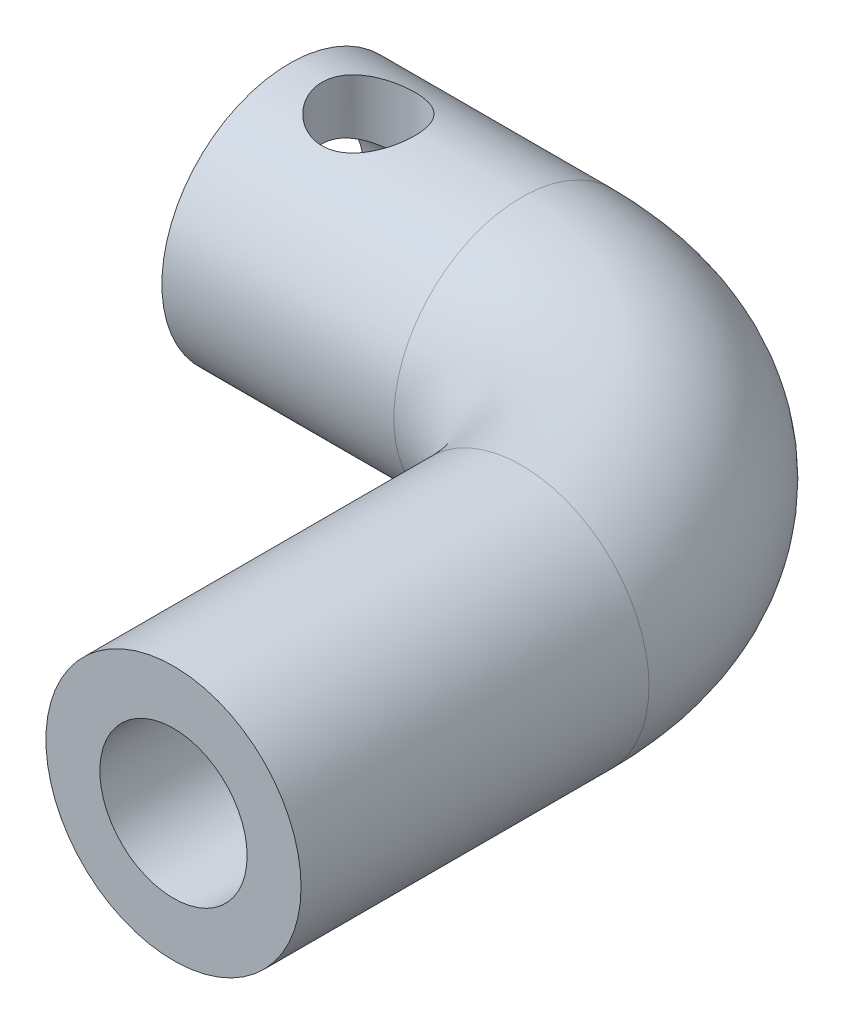
ISO-10303-21;
HEADER;
FILE_DESCRIPTION(('STEP AP214'),'2;1');
FILE_NAME('part.step','',(''),(''),'','','');
FILE_SCHEMA(('AUTOMOTIVE_DESIGN { 1 0 10303 214 1 1 1 1 }'));
ENDSEC;
DATA;
#1=APPLICATION_CONTEXT('core data for automotive mechanical design processes');
#2=APPLICATION_PROTOCOL_DEFINITION('international standard','automotive_design',2000,#1);
#3=PRODUCT_CONTEXT('',#1,'mechanical');
#4=PRODUCT('Part','Part','',(#3));
#5=PRODUCT_RELATED_PRODUCT_CATEGORY('part','',(#4));
#6=PRODUCT_DEFINITION_FORMATION('','',#4);
#7=PRODUCT_DEFINITION_CONTEXT('part definition',#1,'design');
#8=PRODUCT_DEFINITION('design','',#6,#7);
#9=PRODUCT_DEFINITION_SHAPE('','',#8);
#10=(LENGTH_UNIT() NAMED_UNIT(*) SI_UNIT(.MILLI.,.METRE.));
#11=(NAMED_UNIT(*) PLANE_ANGLE_UNIT() SI_UNIT($,.RADIAN.));
#12=(NAMED_UNIT(*) SI_UNIT($,.STERADIAN.) SOLID_ANGLE_UNIT());
#13=UNCERTAINTY_MEASURE_WITH_UNIT(LENGTH_MEASURE(1.E-05),#10,'distance_accuracy_value','');
#14=(GEOMETRIC_REPRESENTATION_CONTEXT(3) GLOBAL_UNCERTAINTY_ASSIGNED_CONTEXT((#13)) GLOBAL_UNIT_ASSIGNED_CONTEXT((#10,
#11,#12)) REPRESENTATION_CONTEXT('',''));
#15=CARTESIAN_POINT('',(0.,0.,0.));
#16=DIRECTION('',(0.,0.,1.));
#17=DIRECTION('',(1.,0.,0.));
#18=AXIS2_PLACEMENT_3D('',#15,#16,#17);
#19=CARTESIAN_POINT('',(-7.5,0.,0.));
#20=DIRECTION('',(-1.,0.,0.));
#21=DIRECTION('',(0.,0.,1.));
#22=AXIS2_PLACEMENT_3D('',#19,#20,#21);
#23=CYLINDRICAL_SURFACE('',#22,3.2);
#24=CARTESIAN_POINT('',(-17.5,0.,0.));
#25=DIRECTION('',(-1.,0.,0.));
#26=DIRECTION('',(0.,0.,1.));
#27=AXIS2_PLACEMENT_3D('',#24,#25,#26);
#28=CIRCLE('',#27,3.2);
#29=CARTESIAN_POINT('',(-17.5,0.,3.2));
#30=VERTEX_POINT('',#29);
#31=EDGE_CURVE('E108',#30,#30,#28,.T.);
#32=ORIENTED_EDGE('',*,*,#31,.T.);
#33=EDGE_LOOP('',(#32));
#34=FACE_BOUND('',#33,.T.);
#35=CARTESIAN_POINT('',(-14.0962512619777,2.49799919935936,-2.));
#36=CARTESIAN_POINT('',(-13.996858811093,2.49801280116094,-1.99999139536776));
#37=CARTESIAN_POINT('',(-13.8973107253853,2.50404228334139,-1.99252310159465));
#38=CARTESIAN_POINT('',(-13.7015691498507,2.52709947528765,-1.96318321332694));
#39=CARTESIAN_POINT('',(-13.6053855237933,2.54415706342585,-1.94127248688881));
#40=CARTESIAN_POINT('',(-13.4197995456595,2.58640136526467,-1.88460918258991));
#41=CARTESIAN_POINT('',(-13.3303462880868,2.61151739868855,-1.84996789332453));
#42=CARTESIAN_POINT('',(-13.1586370833566,2.66692721143094,-1.76915112899075));
#43=CARTESIAN_POINT('',(-13.0763813326072,2.69722113197884,-1.72297533929742));
#44=CARTESIAN_POINT('',(-12.9092670148145,2.76447378199541,-1.61318300685378));
#45=CARTESIAN_POINT('',(-12.8255396766455,2.80178141163757,-1.54805774990795));
#46=CARTESIAN_POINT('',(-12.6692389433457,2.87604513367806,-1.40529386319494));
#47=CARTESIAN_POINT('',(-12.5966752663234,2.9130008938133,-1.32764445007579));
#48=CARTESIAN_POINT('',(-12.4560855257407,2.98767126225618,-1.1506986644135));
#49=CARTESIAN_POINT('',(-12.3896629930108,3.02493955586323,-1.0499209102568));
#50=CARTESIAN_POINT('',(-12.2752509343566,3.09093170718627,-0.835846513339611));
#51=CARTESIAN_POINT('',(-12.2272431567757,3.11966401887744,-0.722562410365085));
#52=CARTESIAN_POINT('',(-12.1562795650064,3.16271746109122,-0.498843005379134));
#53=CARTESIAN_POINT('',(-12.1312729957426,3.17820675875259,-0.3892890176755));
#54=CARTESIAN_POINT('',(-12.1000399505483,3.19760871006727,-0.166568161059514));
#55=CARTESIAN_POINT('',(-12.0937937321849,3.20153353349864,-0.0534052169023041));
#56=CARTESIAN_POINT('',(-12.1000203648219,3.19764654572032,0.156905325474192));
#57=CARTESIAN_POINT('',(-12.1100934640591,3.19133919699003,0.254164037238002));
#58=CARTESIAN_POINT('',(-12.1440384369591,3.17032435617998,0.445290633446095));
#59=CARTESIAN_POINT('',(-12.167911353558,3.15561622920332,0.539158261035764));
#60=CARTESIAN_POINT('',(-12.2284173021329,3.11901013783332,0.721422587322864));
#61=CARTESIAN_POINT('',(-12.2650829804546,3.09709378677711,0.809804600787276));
#62=CARTESIAN_POINT('',(-12.3498012703946,3.04777012623473,0.979230752753056));
#63=CARTESIAN_POINT('',(-12.3978564762059,3.02036156600799,1.06027321370343));
#64=CARTESIAN_POINT('',(-12.5106963265011,2.95829159598973,1.22354162489906));
#65=CARTESIAN_POINT('',(-12.5768186647512,2.92315206882378,1.30465975183771));
#66=CARTESIAN_POINT('',(-12.7204630703495,2.8511274041264,1.45535775348159));
#67=CARTESIAN_POINT('',(-12.7980017043459,2.81423978352652,1.52492054218617));
#68=CARTESIAN_POINT('',(-12.9741802585685,2.73714307341023,1.65976713414942));
#69=CARTESIAN_POINT('',(-13.0742534711014,2.69712930300851,1.723305847132));
#70=CARTESIAN_POINT('',(-13.2860850533787,2.62422622402613,1.83241845071326));
#71=CARTESIAN_POINT('',(-13.3978214122478,2.59132384272274,1.87802543352875));
#72=CARTESIAN_POINT('',(-13.599882306636,2.54547002532879,1.9394970697411));
#73=CARTESIAN_POINT('',(-13.6881088022082,2.5295472689526,1.96002946757177));
#74=CARTESIAN_POINT('',(-13.8676355639661,2.50686622194407,1.98896269657621));
#75=CARTESIAN_POINT('',(-13.958931455639,2.50009541178056,1.99738010164592));
#76=CARTESIAN_POINT('',(-14.1422171508449,2.49673813650095,2.00157657527863));
#77=CARTESIAN_POINT('',(-14.2342080641638,2.50017501025188,1.99732668122696));
#78=CARTESIAN_POINT('',(-14.4159001916276,2.51673668579837,1.97641173689404));
#79=CARTESIAN_POINT('',(-14.5055994459183,2.52986951047321,1.95973640512371));
#80=CARTESIAN_POINT('',(-14.6790006761633,2.56368096963262,1.91527897159771));
#81=CARTESIAN_POINT('',(-14.7627771393083,2.58423164699511,1.8876844900287));
#82=CARTESIAN_POINT('',(-14.9247109972689,2.63064917505314,1.8224392310162));
#83=CARTESIAN_POINT('',(-15.002866385217,2.65651791183846,1.78478488434266));
#84=CARTESIAN_POINT('',(-15.1671409246611,2.71659526382314,1.6922460283571));
#85=CARTESIAN_POINT('',(-15.2519433279767,2.7514540118127,1.63544598102749));
#86=CARTESIAN_POINT('',(-15.4117473458804,2.82230332801138,1.5099044211597));
#87=CARTESIAN_POINT('',(-15.4867386491425,2.85829503845369,1.44115051919448));
#88=CARTESIAN_POINT('',(-15.6370244559668,2.93413062430361,1.28060905519863));
#89=CARTESIAN_POINT('',(-15.7104409531901,2.97366727660159,1.18689591954257));
#90=CARTESIAN_POINT('',(-15.8403611049791,3.04614798344002,0.98607998059122));
#91=CARTESIAN_POINT('',(-15.8968726859356,3.07909512526615,0.878983485997751));
#92=CARTESIAN_POINT('',(-15.987443247902,3.13294809532101,0.660681441018446));
#93=CARTESIAN_POINT('',(-16.022641992331,3.1544557534269,0.550103716071117));
#94=CARTESIAN_POINT('',(-16.0734139318675,3.18571216140865,0.322977598215483));
#95=CARTESIAN_POINT('',(-16.0890142855955,3.19547718292806,0.206437701181278));
#96=CARTESIAN_POINT('',(-16.0987256940398,3.20154697197694,-0.0105585151950039));
#97=CARTESIAN_POINT('',(-16.0956685048369,3.19962560997786,-0.110850076152861));
#98=CARTESIAN_POINT('',(-16.0747125820188,3.18657183934034,-0.309247697746858));
#99=CARTESIAN_POINT('',(-16.0568145218565,3.17543984866428,-0.407353857345283));
#100=CARTESIAN_POINT('',(-16.0079945021751,3.14553767502366,-0.595269271496931));
#101=CARTESIAN_POINT('',(-15.9775459181806,3.1270458795472,-0.685248289085383));
#102=CARTESIAN_POINT('',(-15.9049553769152,3.08391949883621,-0.858742990578189));
#103=CARTESIAN_POINT('',(-15.8628114468167,3.05928387730246,-0.942257580989267));
#104=CARTESIAN_POINT('',(-15.7631943355917,3.00280547583716,-1.10985077995315));
#105=CARTESIAN_POINT('',(-15.7045840918673,2.97048003947126,-1.19308820345962));
#106=CARTESIAN_POINT('',(-15.5761286534453,2.90293824729977,-1.34914657336874));
#107=CARTESIAN_POINT('',(-15.5062707815841,2.86771865168989,-1.42195558888844));
#108=CARTESIAN_POINT('',(-15.3456652422924,2.79200664159236,-1.56595776208136));
#109=CARTESIAN_POINT('',(-15.2533579096946,2.75148594314098,-1.63540527798112));
#110=CARTESIAN_POINT('',(-15.0568197963614,2.67479714395255,-1.75803720009196));
#111=CARTESIAN_POINT('',(-14.9525956541255,2.63862664267279,-1.81123060091365));
#112=CARTESIAN_POINT('',(-14.7580068332901,2.58287641728339,-1.88958577477173));
#113=CARTESIAN_POINT('',(-14.6696341725706,2.56139744559441,-1.91833946042213));
#114=CARTESIAN_POINT('',(-14.4883004172461,2.52702653500701,-1.96340515488654));
#115=CARTESIAN_POINT('',(-14.395354853939,2.5141074304028,-1.97975654792649));
#116=CARTESIAN_POINT('',(-14.2674024237971,2.5036233022303,-1.99295849892956));
#117=CARTESIAN_POINT('',(-14.2332686291505,2.50152111274923,-1.9955947401533));
#118=CARTESIAN_POINT('',(-14.1648465155433,2.49870653912074,-1.99911719574861));
#119=CARTESIAN_POINT('',(-14.130558159895,2.49799450447948,-2.00000297002677));
#120=CARTESIAN_POINT('',(-14.0962512619777,2.49799919935936,-2.));
#121=B_SPLINE_CURVE_WITH_KNOTS('',3,(#35,#36,#37,#38,#39,#40,#41,#42,#43,#44,#45,#46,#47,#48,
#49,#50,#51,#52,#53,#54,#55,#56,#57,#58,#59,#60,#61,#62,#63,#64,#65,#66,#67,#68,#69,#70,#71,#72,
#73,#74,#75,#76,#77,#78,#79,#80,#81,#82,#83,#84,#85,#86,#87,#88,#89,#90,#91,#92,#93,#94,#95,#96,
#97,#98,#99,#100,#101,#102,#103,#104,#105,#106,#107,#108,#109,#110,#111,#112,#113,#114,#115,
#116,#117,#118,#119,#120),.UNSPECIFIED.,.T.,.F.,(4,2,2,2,2,2,2,2,2,2,2,2,2,2,2,2,2,2,2,2,2,2,2,
2,2,2,2,2,2,2,2,2,2,2,2,2,2,2,2,2,2,2,4),(0.,0.298019910419245,0.596850647035399,
0.893128889808709,1.18941521500449,1.52544993190421,1.86177553596668,2.23867577655141,
2.61520148382827,2.95344660504646,3.29133564947829,3.58387711333626,3.8764406892227,
4.16975639721538,4.46313897805083,4.79303207731381,5.12340870425907,5.49692908673939,
5.86975688155524,6.14452440771508,6.41891568014742,6.69393480388261,6.96918174659207,
7.23989139752836,7.51069722382495,7.83306133779285,8.15576157579487,8.53018557860504,
8.90443374501683,9.25632128794359,9.60772066017418,9.90725762443277,10.2067809969681,
10.4959131058616,10.7850940166369,11.1042903057707,11.4238489113727,11.7894690787708,
12.154886553397,12.4399504363574,12.724105247445,12.8269457451427,12.929812095183),.UNSPECIFIED.);
#122=CARTESIAN_POINT('',(-14.0962512619777,2.49799919935936,-2.));
#123=VERTEX_POINT('',#122);
#124=EDGE_CURVE('E150',#123,#123,#121,.T.);
#125=ORIENTED_EDGE('',*,*,#124,.F.);
#126=EDGE_LOOP('',(#125));
#127=FACE_BOUND('',#126,.T.);
#128=DIRECTION('',(-1.,0.,0.));
#129=VECTOR('',#128,1.);
#130=CARTESIAN_POINT('',(-7.5,0.5,-3.16069612585582));
#131=LINE('',#130,#129);
#132=CARTESIAN_POINT('',(-7.5,0.5,-3.16069612585582));
#133=VERTEX_POINT('',#132);
#134=CARTESIAN_POINT('',(-8.5,0.5,-3.16069612585582));
#135=VERTEX_POINT('',#134);
#136=EDGE_CURVE('E69',#133,#135,#131,.T.);
#137=ORIENTED_EDGE('',*,*,#136,.F.);
#138=CARTESIAN_POINT('',(-7.5,0.,0.));
#139=DIRECTION('',(-1.,0.,0.));
#140=DIRECTION('',(0.,0.,1.));
#141=AXIS2_PLACEMENT_3D('',#138,#139,#140);
#142=CIRCLE('',#141,3.2);
#143=CARTESIAN_POINT('',(-7.5,0.5,3.16069612585582));
#144=VERTEX_POINT('',#143);
#145=EDGE_CURVE('E107',#144,#133,#142,.T.);
#146=ORIENTED_EDGE('',*,*,#145,.F.);
#147=DIRECTION('',(-1.,0.,0.));
#148=VECTOR('',#147,1.);
#149=CARTESIAN_POINT('',(-7.5,0.5,3.16069612585582));
#150=LINE('',#149,#148);
#151=CARTESIAN_POINT('',(-8.5,0.5,3.16069612585582));
#152=VERTEX_POINT('',#151);
#153=EDGE_CURVE('E157',#152,#144,#150,.F.);
#154=ORIENTED_EDGE('',*,*,#153,.F.);
#155=CARTESIAN_POINT('',(-8.5,0.,0.));
#156=DIRECTION('',(-1.,0.,0.));
#157=DIRECTION('',(0.,0.,1.));
#158=AXIS2_PLACEMENT_3D('',#155,#156,#157);
#159=CIRCLE('',#158,3.2);
#160=CARTESIAN_POINT('',(-8.5,-0.5,3.16069612585582));
#161=VERTEX_POINT('',#160);
#162=EDGE_CURVE('E49',#152,#161,#159,.F.);
#163=ORIENTED_EDGE('',*,*,#162,.T.);
#164=DIRECTION('',(-1.,0.,0.));
#165=VECTOR('',#164,1.);
#166=CARTESIAN_POINT('',(-7.5,-0.5,3.16069612585582));
#167=LINE('',#166,#165);
#168=CARTESIAN_POINT('',(-7.5,-0.5,3.16069612585582));
#169=VERTEX_POINT('',#168);
#170=EDGE_CURVE('E89',#169,#161,#167,.T.);
#171=ORIENTED_EDGE('',*,*,#170,.F.);
#172=CARTESIAN_POINT('',(-7.5,-0.5,-3.16069612585582));
#173=VERTEX_POINT('',#172);
#174=EDGE_CURVE('E100',#173,#169,#142,.T.);
#175=ORIENTED_EDGE('',*,*,#174,.F.);
#176=DIRECTION('',(-1.,0.,0.));
#177=VECTOR('',#176,1.);
#178=CARTESIAN_POINT('',(-7.5,-0.5,-3.16069612585582));
#179=LINE('',#178,#177);
#180=CARTESIAN_POINT('',(-8.5,-0.5,-3.16069612585582));
#181=VERTEX_POINT('',#180);
#182=EDGE_CURVE('E61',#181,#173,#179,.F.);
#183=ORIENTED_EDGE('',*,*,#182,.F.);
#184=EDGE_CURVE('E11',#181,#135,#159,.F.);
#185=ORIENTED_EDGE('',*,*,#184,.T.);
#186=EDGE_LOOP('',(#137,#146,#154,#163,#171,#175,#183,#185));
#187=FACE_BOUND('',#186,.T.);
#188=ADVANCED_FACE('F45',(#34,#127,#187),#23,.F.);
#189=CARTESIAN_POINT('',(-7.5,0.,0.));
#190=DIRECTION('',(-1.,0.,0.));
#191=DIRECTION('',(0.,0.,1.));
#192=AXIS2_PLACEMENT_3D('',#189,#190,#191);
#193=PLANE('',#192);
#194=ORIENTED_EDGE('',*,*,#145,.T.);
#195=DIRECTION('',(0.,0.,1.));
#196=VECTOR('',#195,1.);
#197=CARTESIAN_POINT('',(-7.5,0.5,0.));
#198=LINE('',#197,#196);
#199=EDGE_CURVE('E95',#133,#144,#198,.T.);
#200=ORIENTED_EDGE('',*,*,#199,.T.);
#201=EDGE_LOOP('',(#194,#200));
#202=FACE_BOUND('',#201,.T.);
#203=ADVANCED_FACE('F170',(#202),#193,.T.);
#204=ORIENTED_EDGE('',*,*,#174,.T.);
#205=DIRECTION('',(0.,0.,-1.));
#206=VECTOR('',#205,1.);
#207=CARTESIAN_POINT('',(-7.5,-0.5,0.));
#208=LINE('',#207,#206);
#209=EDGE_CURVE('E86',#169,#173,#208,.T.);
#210=ORIENTED_EDGE('',*,*,#209,.T.);
#211=EDGE_LOOP('',(#204,#210));
#212=FACE_BOUND('',#211,.T.);
#213=ADVANCED_FACE('F105',(#212),#193,.T.);
#214=CARTESIAN_POINT('',(-7.50000000000005,0.,0.));
#215=DIRECTION('',(-1.,0.,0.));
#216=DIRECTION('',(0.,0.,1.));
#217=AXIS2_PLACEMENT_3D('',#214,#215,#216);
#218=CYLINDRICAL_SURFACE('',#217,5.5);
#219=CARTESIAN_POINT('',(-17.5,0.,0.));
#220=DIRECTION('',(1.,0.,0.));
#221=DIRECTION('',(0.,0.,-1.));
#222=AXIS2_PLACEMENT_3D('',#219,#220,#221);
#223=CIRCLE('',#222,5.5);
#224=CARTESIAN_POINT('',(-17.5,0.,-5.5));
#225=VERTEX_POINT('',#224);
#226=EDGE_CURVE('E96',#225,#225,#223,.T.);
#227=ORIENTED_EDGE('',*,*,#226,.T.);
#228=EDGE_LOOP('',(#227));
#229=FACE_BOUND('',#228,.T.);
#230=CARTESIAN_POINT('',(-7.50000000000005,0.,0.));
#231=DIRECTION('',(1.,0.,0.));
#232=DIRECTION('',(0.,0.,-1.));
#233=AXIS2_PLACEMENT_3D('',#230,#231,#232);
#234=CIRCLE('',#233,5.5);
#235=CARTESIAN_POINT('',(-7.50000000000008,0.,-5.5));
#236=VERTEX_POINT('',#235);
#237=EDGE_CURVE('E143',#236,#236,#234,.T.);
#238=ORIENTED_EDGE('',*,*,#237,.F.);
#239=EDGE_LOOP('',(#238));
#240=FACE_BOUND('',#239,.T.);
#241=CARTESIAN_POINT('',(-16.0962512619777,5.5,0.));
#242=CARTESIAN_POINT('',(-16.0962540749037,5.50000205657184,0.108543167224903));
#243=CARTESIAN_POINT('',(-16.0873870672319,5.49675838182447,0.217066536046161));
#244=CARTESIAN_POINT('',(-16.05228680681,5.4841414750815,0.430882793323262));
#245=CARTESIAN_POINT('',(-16.026054888442,5.47476871406757,0.536175929351336));
#246=CARTESIAN_POINT('',(-15.9572665501313,5.45090325673945,0.740417965464447));
#247=CARTESIAN_POINT('',(-15.9147404536697,5.43642007485985,0.839378254121704));
#248=CARTESIAN_POINT('',(-15.8147203138637,5.4037862710006,1.02875621286126));
#249=CARTESIAN_POINT('',(-15.7572225233078,5.38563473113581,1.11917173657256));
#250=CARTESIAN_POINT('',(-15.6264672787922,5.34673088503245,1.29253694990834));
#251=CARTESIAN_POINT('',(-15.5527132142648,5.32590805596802,1.37509612786369));
#252=CARTESIAN_POINT('',(-15.3925935131786,5.28436672781322,1.52698399161499));
#253=CARTESIAN_POINT('',(-15.306224355575,5.26364825952702,1.59630897106152));
#254=CARTESIAN_POINT('',(-15.1195962124677,5.2238538559819,1.72217040965031));
#255=CARTESIAN_POINT('',(-15.0189539897892,5.20486193866807,1.77816779943083));
#256=CARTESIAN_POINT('',(-14.8088797859481,5.17176122573932,1.87226939440076));
#257=CARTESIAN_POINT('',(-14.6994510953729,5.15765061245797,1.91038026194013));
#258=CARTESIAN_POINT('',(-14.4793926052292,5.13666087499578,1.9661067634546));
#259=CARTESIAN_POINT('',(-14.3689763262856,5.12952103621697,1.98446417009746));
#260=CARTESIAN_POINT('',(-14.1464175062078,5.12251577517209,2.00248218153331));
#261=CARTESIAN_POINT('',(-14.0342756408192,5.12264757431404,2.0021499278993));
#262=CARTESIAN_POINT('',(-13.8180990594426,5.1299448506341,1.98336767767184));
#263=CARTESIAN_POINT('',(-13.7139608567425,5.13671788212537,1.96592854222369));
#264=CARTESIAN_POINT('',(-13.5102048002903,5.15588510806292,1.91509242052769));
#265=CARTESIAN_POINT('',(-13.4105875885507,5.16828009813625,1.88169317554809));
#266=CARTESIAN_POINT('',(-13.2165748993959,5.19754287313288,1.79930048548219));
#267=CARTESIAN_POINT('',(-13.1223073219326,5.21448789682278,1.75003450500502));
#268=CARTESIAN_POINT('',(-12.9430765104296,5.25091385937534,1.63749646562567));
#269=CARTESIAN_POINT('',(-12.8581163634627,5.27039563496267,1.57421978057422));
#270=CARTESIAN_POINT('',(-12.694291552473,5.31119569956226,1.43076675943658));
#271=CARTESIAN_POINT('',(-12.6161463481083,5.33255243042912,1.34977782823104));
#272=CARTESIAN_POINT('',(-12.4743402514832,5.3736374984068,1.17559287826596));
#273=CARTESIAN_POINT('',(-12.4106813274115,5.39336561401291,1.08239520346403));
#274=CARTESIAN_POINT('',(-12.2989240994863,5.42932219694274,0.88469148247814));
#275=CARTESIAN_POINT('',(-12.2510520390387,5.44549875602857,0.780047440423985));
#276=CARTESIAN_POINT('',(-12.1738261193611,5.47214720693442,0.563457919122987));
#277=CARTESIAN_POINT('',(-12.1444645464187,5.48262147477141,0.451515502750676));
#278=CARTESIAN_POINT('',(-12.1064452489037,5.49627428963535,0.229572167352699));
#279=CARTESIAN_POINT('',(-12.0968177974848,5.49979422865534,0.119758188935125));
#280=CARTESIAN_POINT('',(-12.0957337267991,5.50018795318754,-0.099959133562812));
#281=CARTESIAN_POINT('',(-12.1042733610299,5.49706310901842,-0.209862454546218));
#282=CARTESIAN_POINT('',(-12.1385346683936,5.48474392235953,-0.42253626073088));
#283=CARTESIAN_POINT('',(-12.1636324866368,5.47577009231647,-0.525421334588075));
#284=CARTESIAN_POINT('',(-12.2294881181432,5.45287588831335,-0.725457170096086));
#285=CARTESIAN_POINT('',(-12.2702479682028,5.43895487100538,-0.822607184024532));
#286=CARTESIAN_POINT('',(-12.3675468187183,5.40705571750078,-1.01153077639211));
#287=CARTESIAN_POINT('',(-12.4245046117121,5.38897272874452,-1.10307043335863));
#288=CARTESIAN_POINT('',(-12.5521043618453,5.35076522574993,-1.27559067705659));
#289=CARTESIAN_POINT('',(-12.6227511472205,5.3306399923892,-1.35656752127386));
#290=CARTESIAN_POINT('',(-12.7802590501279,5.28921180356834,-1.51027155013883));
#291=CARTESIAN_POINT('',(-12.8677938201049,5.26790441656513,-1.58230898792662));
#292=CARTESIAN_POINT('',(-13.0541422454302,5.22759328693503,-1.71079410152422));
#293=CARTESIAN_POINT('',(-13.1529566062335,5.20858968854653,-1.76724080149289));
#294=CARTESIAN_POINT('',(-13.3596242092117,5.1751541927476,-1.86289185191077));
#295=CARTESIAN_POINT('',(-13.4674960600196,5.16073201356674,-1.90205961728944));
#296=CARTESIAN_POINT('',(-13.6889687098691,5.13846087649098,-1.96143954674718));
#297=CARTESIAN_POINT('',(-13.8025662107052,5.13060817917034,-1.98166249522347));
#298=CARTESIAN_POINT('',(-14.024842570137,5.12284228170685,-2.00164701057721));
#299=CARTESIAN_POINT('',(-14.1334016297174,5.1224762355533,-2.00257568987819));
#300=CARTESIAN_POINT('',(-14.349040828731,5.12857566975998,-1.98690232545375));
#301=CARTESIAN_POINT('',(-14.4561210910641,5.13504057890957,-1.97030174754071));
#302=CARTESIAN_POINT('',(-14.6628462177125,5.15370717596286,-1.92092825934282));
#303=CARTESIAN_POINT('',(-14.7626137211752,5.16574946028865,-1.88860353628273));
#304=CARTESIAN_POINT('',(-14.9553740420676,5.19413013423955,-1.80908422608117));
#305=CARTESIAN_POINT('',(-15.0483651912345,5.21046957724445,-1.76188599237303));
#306=CARTESIAN_POINT('',(-15.2299927161777,5.24662240525316,-1.6512114794778));
#307=CARTESIAN_POINT('',(-15.3181776581623,5.26656880255672,-1.58703826418065));
#308=CARTESIAN_POINT('',(-15.4829014136564,5.30720401505186,-1.44534172486944));
#309=CARTESIAN_POINT('',(-15.5594366266818,5.32789305733489,-1.36781428929525));
#310=CARTESIAN_POINT('',(-15.7025507282668,5.36891606148755,-1.19700369898172));
#311=CARTESIAN_POINT('',(-15.7684467617807,5.38918141250994,-1.10312945402949));
#312=CARTESIAN_POINT('',(-15.8834883375495,5.42597802894301,-0.90493584787187));
#313=CARTESIAN_POINT('',(-15.9326342450026,5.44250937576248,-0.800616714457644));
#314=CARTESIAN_POINT('',(-16.0131609298506,5.47019903727863,-0.582422816702627));
#315=CARTESIAN_POINT('',(-16.0442026659552,5.48125425902285,-0.468408860492773));
#316=CARTESIAN_POINT('',(-16.0857419075774,5.49615207881264,-0.236254263243528));
#317=CARTESIAN_POINT('',(-16.0962482009844,5.49999776206249,-0.118115409443586));
#318=CARTESIAN_POINT('',(-16.0962512619777,5.5,0.));
#319=B_SPLINE_CURVE_WITH_KNOTS('',3,(#241,#242,#243,#244,#245,#246,#247,#248,#249,#250,#251,
#252,#253,#254,#255,#256,#257,#258,#259,#260,#261,#262,#263,#264,#265,#266,#267,#268,#269,#270,
#271,#272,#273,#274,#275,#276,#277,#278,#279,#280,#281,#282,#283,#284,#285,#286,#287,#288,#289,
#290,#291,#292,#293,#294,#295,#296,#297,#298,#299,#300,#301,#302,#303,#304,#305,#306,#307,#308,
#309,#310,#311,#312,#313,#314,#315,#316,#317,#318),.UNSPECIFIED.,.T.,.F.,(4,2,2,2,2,2,2,2,2,2,2,
2,2,2,2,2,2,2,2,2,2,2,2,2,2,2,2,2,2,2,2,2,2,2,2,2,2,2,4),(0.,0.325194104136432,
0.650363222090041,0.97493011631894,1.2995783234422,1.63601964163853,1.97255504528971,
2.32099392094054,2.66930290729856,3.00401939097087,3.33860797579857,3.65454759073094,
3.97053193181531,4.29226244373356,4.61409934564611,4.95617818949658,5.29830348241717,
5.64513792605579,5.99182774072784,6.32102805388949,6.65016048438683,6.96755079702181,
7.2849823992121,7.61151258405805,7.93815814949471,8.28259860829996,8.62706062112335,
8.97224851093866,9.31723978183251,9.64129740492555,9.96532793217199,10.2806204101951,
10.5959902492892,10.9271566786297,11.2584252518918,11.6061385710831,11.9538443086926,
12.3078682758854,12.6617407096898),.UNSPECIFIED.);
#320=CARTESIAN_POINT('',(-16.0962512619777,5.5,0.));
#321=VERTEX_POINT('',#320);
#322=EDGE_CURVE('E118',#321,#321,#319,.T.);
#323=ORIENTED_EDGE('',*,*,#322,.F.);
#324=EDGE_LOOP('',(#323));
#325=FACE_BOUND('',#324,.T.);
#326=ADVANCED_FACE('F178',(#229,#240,#325),#218,.T.);
#327=CARTESIAN_POINT('',(2.5,0.,25.));
#328=DIRECTION('',(0.,0.,1.));
#329=DIRECTION('',(1.,0.,0.));
#330=AXIS2_PLACEMENT_3D('',#327,#328,#329);
#331=PLANE('',#330);
#332=CARTESIAN_POINT('',(2.5,0.,25.));
#333=DIRECTION('',(0.,0.,1.));
#334=DIRECTION('',(1.,0.,0.));
#335=AXIS2_PLACEMENT_3D('',#332,#333,#334);
#336=CIRCLE('',#335,3.175);
#337=CARTESIAN_POINT('',(5.675,0.,25.));
#338=VERTEX_POINT('',#337);
#339=EDGE_CURVE('E115',#338,#338,#336,.T.);
#340=ORIENTED_EDGE('',*,*,#339,.F.);
#341=EDGE_LOOP('',(#340));
#342=FACE_BOUND('',#341,.T.);
#343=CARTESIAN_POINT('',(2.5,0.,25.));
#344=DIRECTION('',(0.,0.,1.));
#345=DIRECTION('',(1.,0.,0.));
#346=AXIS2_PLACEMENT_3D('',#343,#344,#345);
#347=CIRCLE('',#346,5.5);
#348=CARTESIAN_POINT('',(8.,0.,25.));
#349=VERTEX_POINT('',#348);
#350=EDGE_CURVE('E132',#349,#349,#347,.T.);
#351=ORIENTED_EDGE('',*,*,#350,.T.);
#352=EDGE_LOOP('',(#351));
#353=FACE_BOUND('',#352,.T.);
#354=ADVANCED_FACE('F47',(#342,#353),#331,.T.);
#355=CARTESIAN_POINT('',(-17.5,0.,0.));
#356=DIRECTION('',(1.,0.,0.));
#357=DIRECTION('',(0.,0.,-1.));
#358=AXIS2_PLACEMENT_3D('',#355,#356,#357);
#359=PLANE('',#358);
#360=ORIENTED_EDGE('',*,*,#31,.F.);
#361=EDGE_LOOP('',(#360));
#362=FACE_BOUND('',#361,.T.);
#363=ORIENTED_EDGE('',*,*,#226,.F.);
#364=EDGE_LOOP('',(#363));
#365=FACE_BOUND('',#364,.T.);
#366=ADVANCED_FACE('F224',(#362,#365),#359,.F.);
#367=CARTESIAN_POINT('',(2.5,0.,25.));
#368=DIRECTION('',(0.,0.,-1.));
#369=DIRECTION('',(-1.,0.,0.));
#370=AXIS2_PLACEMENT_3D('',#367,#368,#369);
#371=CYLINDRICAL_SURFACE('',#370,5.5);
#372=CARTESIAN_POINT('',(2.5,0.,10.));
#373=DIRECTION('',(0.,0.,1.));
#374=DIRECTION('',(1.,0.,0.));
#375=AXIS2_PLACEMENT_3D('',#372,#373,#374);
#376=CIRCLE('',#375,5.5);
#377=CARTESIAN_POINT('',(8.,0.,10.));
#378=VERTEX_POINT('',#377);
#379=EDGE_CURVE('E139',#378,#378,#376,.T.);
#380=ORIENTED_EDGE('',*,*,#379,.T.);
#381=EDGE_LOOP('',(#380));
#382=FACE_BOUND('',#381,.T.);
#383=ORIENTED_EDGE('',*,*,#350,.F.);
#384=EDGE_LOOP('',(#383));
#385=FACE_BOUND('',#384,.T.);
#386=ADVANCED_FACE('F231',(#382,#385),#371,.T.);
#387=CARTESIAN_POINT('',(-7.5,0.,10.));
#388=DIRECTION('',(0.,1.,0.));
#389=DIRECTION('',(0.,0.,1.));
#390=AXIS2_PLACEMENT_3D('',#387,#388,#389);
#391=TOROIDAL_SURFACE('',#390,10.,5.5);
#392=CARTESIAN_POINT('',(-7.5,0.,10.));
#393=DIRECTION('',(0.,1.,0.));
#394=DIRECTION('',(0.,0.,1.));
#395=AXIS2_PLACEMENT_3D('',#392,#393,#394);
#396=CIRCLE('',#395,15.5);
#397=EDGE_CURVE('',#378,#236,#396,.T.);
#398=ORIENTED_EDGE('',*,*,#379,.F.);
#399=ORIENTED_EDGE('',*,*,#237,.T.);
#400=ORIENTED_EDGE('',*,*,#397,.T.);
#401=ORIENTED_EDGE('',*,*,#397,.F.);
#402=EDGE_LOOP('',(#398,#400,#399,#401));
#403=FACE_BOUND('',#402,.T.);
#404=ADVANCED_FACE('F220',(#403),#391,.T.);
#405=CARTESIAN_POINT('',(2.5,0.,15.));
#406=DIRECTION('',(0.,0.,1.));
#407=DIRECTION('',(1.,0.,0.));
#408=AXIS2_PLACEMENT_3D('',#405,#406,#407);
#409=CYLINDRICAL_SURFACE('',#408,3.175);
#410=CARTESIAN_POINT('',(2.5,0.,15.));
#411=DIRECTION('',(0.,0.,1.));
#412=DIRECTION('',(1.,0.,0.));
#413=AXIS2_PLACEMENT_3D('',#410,#411,#412);
#414=CIRCLE('',#413,3.175);
#415=CARTESIAN_POINT('',(5.675,0.,15.));
#416=VERTEX_POINT('',#415);
#417=EDGE_CURVE('E128',#416,#416,#414,.T.);
#418=ORIENTED_EDGE('',*,*,#417,.F.);
#419=EDGE_LOOP('',(#418));
#420=FACE_BOUND('',#419,.T.);
#421=ORIENTED_EDGE('',*,*,#339,.T.);
#422=EDGE_LOOP('',(#421));
#423=FACE_BOUND('',#422,.T.);
#424=ADVANCED_FACE('F226',(#420,#423),#409,.F.);
#425=CARTESIAN_POINT('',(2.5,0.,15.));
#426=DIRECTION('',(0.,0.,1.));
#427=DIRECTION('',(1.,0.,0.));
#428=AXIS2_PLACEMENT_3D('',#425,#426,#427);
#429=PLANE('',#428);
#430=ORIENTED_EDGE('',*,*,#417,.T.);
#431=EDGE_LOOP('',(#430));
#432=FACE_BOUND('',#431,.T.);
#433=ADVANCED_FACE('F166',(#432),#429,.T.);
#434=CARTESIAN_POINT('',(-14.0962512619777,5.5,0.));
#435=DIRECTION('',(0.,-1.,0.));
#436=DIRECTION('',(0.,0.,-1.));
#437=AXIS2_PLACEMENT_3D('',#434,#435,#436);
#438=CYLINDRICAL_SURFACE('',#437,2.);
#439=ORIENTED_EDGE('',*,*,#124,.T.);
#440=EDGE_LOOP('',(#439));
#441=FACE_BOUND('',#440,.T.);
#442=ORIENTED_EDGE('',*,*,#322,.T.);
#443=EDGE_LOOP('',(#442));
#444=FACE_BOUND('',#443,.T.);
#445=ADVANCED_FACE('F161',(#441,#444),#438,.F.);
#446=CARTESIAN_POINT('',(-8.5,0.,0.));
#447=DIRECTION('',(-1.,0.,0.));
#448=DIRECTION('',(0.,0.,1.));
#449=AXIS2_PLACEMENT_3D('',#446,#447,#448);
#450=PLANE('',#449);
#451=ORIENTED_EDGE('',*,*,#184,.F.);
#452=DIRECTION('',(0.,0.,1.));
#453=VECTOR('',#452,1.);
#454=CARTESIAN_POINT('',(-8.5,-0.5,-3.36895576613342));
#455=LINE('',#454,#453);
#456=EDGE_CURVE('E103',#181,#161,#455,.T.);
#457=ORIENTED_EDGE('',*,*,#456,.T.);
#458=ORIENTED_EDGE('',*,*,#162,.F.);
#459=DIRECTION('',(0.,0.,-1.));
#460=VECTOR('',#459,1.);
#461=CARTESIAN_POINT('',(-8.5,0.5,-3.36895576613342));
#462=LINE('',#461,#460);
#463=EDGE_CURVE('E191',#152,#135,#462,.T.);
#464=ORIENTED_EDGE('',*,*,#463,.T.);
#465=EDGE_LOOP('',(#451,#457,#458,#464));
#466=FACE_BOUND('',#465,.T.);
#467=ADVANCED_FACE('F165',(#466),#450,.T.);
#468=CARTESIAN_POINT('',(-8.5,0.5,-3.36895576613342));
#469=DIRECTION('',(0.,-1.,0.));
#470=DIRECTION('',(0.,0.,-1.));
#471=AXIS2_PLACEMENT_3D('',#468,#469,#470);
#472=PLANE('',#471);
#473=ORIENTED_EDGE('',*,*,#463,.F.);
#474=ORIENTED_EDGE('',*,*,#153,.T.);
#475=ORIENTED_EDGE('',*,*,#199,.F.);
#476=ORIENTED_EDGE('',*,*,#136,.T.);
#477=EDGE_LOOP('',(#473,#474,#475,#476));
#478=FACE_BOUND('',#477,.T.);
#479=ADVANCED_FACE('F168',(#478),#472,.F.);
#480=CARTESIAN_POINT('',(-8.5,-0.5,-3.36895576613342));
#481=DIRECTION('',(0.,1.,0.));
#482=DIRECTION('',(0.,0.,1.));
#483=AXIS2_PLACEMENT_3D('',#480,#481,#482);
#484=PLANE('',#483);
#485=ORIENTED_EDGE('',*,*,#456,.F.);
#486=ORIENTED_EDGE('',*,*,#182,.T.);
#487=ORIENTED_EDGE('',*,*,#209,.F.);
#488=ORIENTED_EDGE('',*,*,#170,.T.);
#489=EDGE_LOOP('',(#485,#486,#487,#488));
#490=FACE_BOUND('',#489,.T.);
#491=ADVANCED_FACE('F88',(#490),#484,.F.);
#492=CLOSED_SHELL('',(#188,#203,#213,#326,#354,#366,#386,#404,#424,#433,#445,#467,#479,#491));
#493=MANIFOLD_SOLID_BREP('B2',#492);
#494=ADVANCED_BREP_SHAPE_REPRESENTATION('',(#18,#493),#14);
#495=SHAPE_DEFINITION_REPRESENTATION(#9,#494);
ENDSEC;
END-ISO-10303-21;
